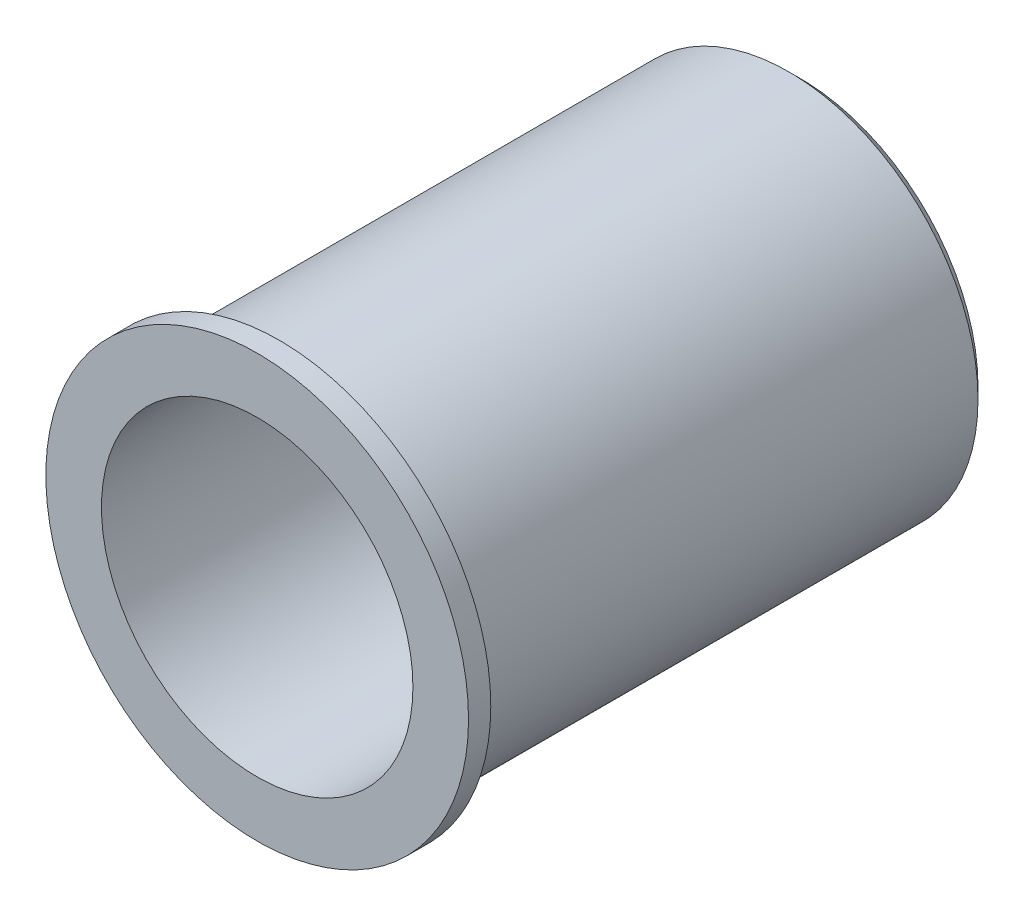
ISO-10303-21;
HEADER;
FILE_DESCRIPTION(('STEP AP214'),'2;1');
FILE_NAME('part.step','',(''),(''),'','','');
FILE_SCHEMA(('AUTOMOTIVE_DESIGN { 1 0 10303 214 1 1 1 1 }'));
ENDSEC;
DATA;
#1=APPLICATION_CONTEXT('core data for automotive mechanical design processes');
#2=APPLICATION_PROTOCOL_DEFINITION('international standard','automotive_design',2000,#1);
#3=PRODUCT_CONTEXT('',#1,'mechanical');
#4=PRODUCT('Part','Part','',(#3));
#5=PRODUCT_RELATED_PRODUCT_CATEGORY('part','',(#4));
#6=PRODUCT_DEFINITION_FORMATION('','',#4);
#7=PRODUCT_DEFINITION_CONTEXT('part definition',#1,'design');
#8=PRODUCT_DEFINITION('design','',#6,#7);
#9=PRODUCT_DEFINITION_SHAPE('','',#8);
#10=(LENGTH_UNIT() NAMED_UNIT(*) SI_UNIT(.MILLI.,.METRE.));
#11=(NAMED_UNIT(*) PLANE_ANGLE_UNIT() SI_UNIT($,.RADIAN.));
#12=(NAMED_UNIT(*) SI_UNIT($,.STERADIAN.) SOLID_ANGLE_UNIT());
#13=UNCERTAINTY_MEASURE_WITH_UNIT(LENGTH_MEASURE(1.E-05),#10,'distance_accuracy_value','');
#14=(GEOMETRIC_REPRESENTATION_CONTEXT(3) GLOBAL_UNCERTAINTY_ASSIGNED_CONTEXT((#13)) GLOBAL_UNIT_ASSIGNED_CONTEXT((#10,
#11,#12)) REPRESENTATION_CONTEXT('',''));
#15=CARTESIAN_POINT('',(0.,0.,0.));
#16=DIRECTION('',(0.,0.,1.));
#17=DIRECTION('',(1.,0.,0.));
#18=AXIS2_PLACEMENT_3D('',#15,#16,#17);
#19=CARTESIAN_POINT('',(0.,0.,24.4));
#20=DIRECTION('',(0.,0.,1.));
#21=DIRECTION('',(1.,0.,0.));
#22=AXIS2_PLACEMENT_3D('',#19,#20,#21);
#23=PLANE('',#22);
#24=CARTESIAN_POINT('',(0.,0.,24.4));
#25=DIRECTION('',(0.,0.,1.));
#26=DIRECTION('',(1.,0.,0.));
#27=AXIS2_PLACEMENT_3D('',#24,#25,#26);
#28=CIRCLE('',#27,7.);
#29=CARTESIAN_POINT('',(7.,0.,24.4));
#30=VERTEX_POINT('',#29);
#31=EDGE_CURVE('E33',#30,#30,#28,.T.);
#32=ORIENTED_EDGE('',*,*,#31,.F.);
#33=EDGE_LOOP('',(#32));
#34=FACE_BOUND('',#33,.T.);
#35=CARTESIAN_POINT('',(0.,0.,24.4));
#36=DIRECTION('',(0.,0.,1.));
#37=DIRECTION('',(1.,0.,0.));
#38=AXIS2_PLACEMENT_3D('',#35,#36,#37);
#39=CIRCLE('',#38,9.5);
#40=CARTESIAN_POINT('',(9.5,0.,24.4));
#41=VERTEX_POINT('',#40);
#42=EDGE_CURVE('E39',#41,#41,#39,.T.);
#43=ORIENTED_EDGE('',*,*,#42,.T.);
#44=EDGE_LOOP('',(#43));
#45=FACE_BOUND('',#44,.T.);
#46=ADVANCED_FACE('F15',(#34,#45),#23,.T.);
#47=CARTESIAN_POINT('',(0.,0.,2.));
#48=DIRECTION('',(0.,0.,1.));
#49=DIRECTION('',(1.,0.,0.));
#50=AXIS2_PLACEMENT_3D('',#47,#48,#49);
#51=CYLINDRICAL_SURFACE('',#50,7.);
#52=CARTESIAN_POINT('',(0.,0.,2.));
#53=DIRECTION('',(0.,0.,1.));
#54=DIRECTION('',(1.,0.,0.));
#55=AXIS2_PLACEMENT_3D('',#52,#53,#54);
#56=CIRCLE('',#55,7.);
#57=CARTESIAN_POINT('',(7.,0.,2.));
#58=VERTEX_POINT('',#57);
#59=EDGE_CURVE('E30',#58,#58,#56,.F.);
#60=ORIENTED_EDGE('',*,*,#59,.T.);
#61=EDGE_LOOP('',(#60));
#62=FACE_BOUND('',#61,.T.);
#63=ORIENTED_EDGE('',*,*,#31,.T.);
#64=EDGE_LOOP('',(#63));
#65=FACE_BOUND('',#64,.T.);
#66=ADVANCED_FACE('F87',(#62,#65),#51,.F.);
#67=CARTESIAN_POINT('',(0.,0.,2.));
#68=DIRECTION('',(0.,0.,1.));
#69=DIRECTION('',(1.,0.,0.));
#70=AXIS2_PLACEMENT_3D('',#67,#68,#69);
#71=PLANE('',#70);
#72=CARTESIAN_POINT('',(-2.5,-4.33012701892219,2.));
#73=DIRECTION('',(0.,0.,1.));
#74=DIRECTION('',(1.,0.,0.));
#75=AXIS2_PLACEMENT_3D('',#72,#73,#74);
#76=CIRCLE('',#75,1.25);
#77=CARTESIAN_POINT('',(-1.25,-4.33012701892219,2.));
#78=VERTEX_POINT('',#77);
#79=EDGE_CURVE('E62',#78,#78,#76,.T.);
#80=ORIENTED_EDGE('',*,*,#79,.F.);
#81=EDGE_LOOP('',(#80));
#82=FACE_BOUND('',#81,.T.);
#83=CARTESIAN_POINT('',(-2.5,4.3301270189222,2.));
#84=DIRECTION('',(0.,0.,1.));
#85=DIRECTION('',(1.,0.,0.));
#86=AXIS2_PLACEMENT_3D('',#83,#84,#85);
#87=CIRCLE('',#86,1.25);
#88=CARTESIAN_POINT('',(-1.25,4.3301270189222,2.));
#89=VERTEX_POINT('',#88);
#90=EDGE_CURVE('E56',#89,#89,#87,.T.);
#91=ORIENTED_EDGE('',*,*,#90,.F.);
#92=EDGE_LOOP('',(#91));
#93=FACE_BOUND('',#92,.T.);
#94=CARTESIAN_POINT('',(5.,0.,2.));
#95=DIRECTION('',(0.,0.,1.));
#96=DIRECTION('',(1.,0.,0.));
#97=AXIS2_PLACEMENT_3D('',#94,#95,#96);
#98=CIRCLE('',#97,1.25);
#99=CARTESIAN_POINT('',(6.25,0.,2.));
#100=VERTEX_POINT('',#99);
#101=EDGE_CURVE('E50',#100,#100,#98,.T.);
#102=ORIENTED_EDGE('',*,*,#101,.F.);
#103=EDGE_LOOP('',(#102));
#104=FACE_BOUND('',#103,.T.);
#105=CARTESIAN_POINT('',(0.,0.,2.));
#106=DIRECTION('',(0.,0.,1.));
#107=DIRECTION('',(1.,0.,0.));
#108=AXIS2_PLACEMENT_3D('',#105,#106,#107);
#109=CIRCLE('',#108,1.5);
#110=CARTESIAN_POINT('',(1.5,0.,2.));
#111=VERTEX_POINT('',#110);
#112=EDGE_CURVE('E42',#111,#111,#109,.T.);
#113=ORIENTED_EDGE('',*,*,#112,.F.);
#114=EDGE_LOOP('',(#113));
#115=FACE_BOUND('',#114,.T.);
#116=ORIENTED_EDGE('',*,*,#59,.F.);
#117=EDGE_LOOP('',(#116));
#118=FACE_BOUND('',#117,.T.);
#119=ADVANCED_FACE('F93',(#82,#93,#104,#115,#118),#71,.T.);
#120=CARTESIAN_POINT('',(0.,0.,23.4));
#121=DIRECTION('',(0.,0.,1.));
#122=DIRECTION('',(1.,0.,0.));
#123=AXIS2_PLACEMENT_3D('',#120,#121,#122);
#124=CYLINDRICAL_SURFACE('',#123,9.5);
#125=CARTESIAN_POINT('',(0.,0.,23.4));
#126=DIRECTION('',(0.,0.,1.));
#127=DIRECTION('',(1.,0.,0.));
#128=AXIS2_PLACEMENT_3D('',#125,#126,#127);
#129=CIRCLE('',#128,9.5);
#130=CARTESIAN_POINT('',(9.5,0.,23.4));
#131=VERTEX_POINT('',#130);
#132=EDGE_CURVE('E36',#131,#131,#129,.T.);
#133=ORIENTED_EDGE('',*,*,#132,.T.);
#134=EDGE_LOOP('',(#133));
#135=FACE_BOUND('',#134,.T.);
#136=ORIENTED_EDGE('',*,*,#42,.F.);
#137=EDGE_LOOP('',(#136));
#138=FACE_BOUND('',#137,.T.);
#139=ADVANCED_FACE('F114',(#135,#138),#124,.T.);
#140=CARTESIAN_POINT('',(0.,0.,23.4));
#141=DIRECTION('',(0.,0.,1.));
#142=DIRECTION('',(1.,0.,0.));
#143=AXIS2_PLACEMENT_3D('',#140,#141,#142);
#144=PLANE('',#143);
#145=ORIENTED_EDGE('',*,*,#132,.F.);
#146=EDGE_LOOP('',(#145));
#147=FACE_BOUND('',#146,.T.);
#148=CARTESIAN_POINT('',(0.,0.,23.4));
#149=DIRECTION('',(0.,0.,1.));
#150=DIRECTION('',(1.,0.,0.));
#151=AXIS2_PLACEMENT_3D('',#148,#149,#150);
#152=CIRCLE('',#151,8.5);
#153=CARTESIAN_POINT('',(8.5,0.,23.4));
#154=VERTEX_POINT('',#153);
#155=EDGE_CURVE('E26',#154,#154,#152,.T.);
#156=ORIENTED_EDGE('',*,*,#155,.T.);
#157=EDGE_LOOP('',(#156));
#158=FACE_BOUND('',#157,.T.);
#159=ADVANCED_FACE('F102',(#147,#158),#144,.F.);
#160=CARTESIAN_POINT('',(0.,0.,0.));
#161=DIRECTION('',(0.,0.,1.));
#162=DIRECTION('',(1.,0.,0.));
#163=AXIS2_PLACEMENT_3D('',#160,#161,#162);
#164=PLANE('',#163);
#165=CARTESIAN_POINT('',(0.,0.,0.));
#166=DIRECTION('',(0.,0.,1.));
#167=DIRECTION('',(1.,0.,0.));
#168=AXIS2_PLACEMENT_3D('',#165,#166,#167);
#169=CIRCLE('',#168,8.);
#170=CARTESIAN_POINT('',(8.,0.,0.));
#171=VERTEX_POINT('',#170);
#172=EDGE_CURVE('E10',#171,#171,#169,.F.);
#173=ORIENTED_EDGE('',*,*,#172,.T.);
#174=EDGE_LOOP('',(#173));
#175=FACE_BOUND('',#174,.T.);
#176=CARTESIAN_POINT('',(-2.5,-4.33012701892219,0.));
#177=DIRECTION('',(0.,0.,1.));
#178=DIRECTION('',(1.,0.,0.));
#179=AXIS2_PLACEMENT_3D('',#176,#177,#178);
#180=CIRCLE('',#179,1.25);
#181=CARTESIAN_POINT('',(-1.25,-4.33012701892219,0.));
#182=VERTEX_POINT('',#181);
#183=EDGE_CURVE('E65',#182,#182,#180,.T.);
#184=ORIENTED_EDGE('',*,*,#183,.T.);
#185=EDGE_LOOP('',(#184));
#186=FACE_BOUND('',#185,.T.);
#187=CARTESIAN_POINT('',(-2.5,4.3301270189222,0.));
#188=DIRECTION('',(0.,0.,1.));
#189=DIRECTION('',(1.,0.,0.));
#190=AXIS2_PLACEMENT_3D('',#187,#188,#189);
#191=CIRCLE('',#190,1.25);
#192=CARTESIAN_POINT('',(-1.25,4.3301270189222,0.));
#193=VERTEX_POINT('',#192);
#194=EDGE_CURVE('E59',#193,#193,#191,.T.);
#195=ORIENTED_EDGE('',*,*,#194,.T.);
#196=EDGE_LOOP('',(#195));
#197=FACE_BOUND('',#196,.T.);
#198=CARTESIAN_POINT('',(5.,0.,0.));
#199=DIRECTION('',(0.,0.,1.));
#200=DIRECTION('',(1.,0.,0.));
#201=AXIS2_PLACEMENT_3D('',#198,#199,#200);
#202=CIRCLE('',#201,1.25);
#203=CARTESIAN_POINT('',(6.25,0.,0.));
#204=VERTEX_POINT('',#203);
#205=EDGE_CURVE('E53',#204,#204,#202,.T.);
#206=ORIENTED_EDGE('',*,*,#205,.T.);
#207=EDGE_LOOP('',(#206));
#208=FACE_BOUND('',#207,.T.);
#209=CARTESIAN_POINT('',(0.,0.,0.));
#210=DIRECTION('',(0.,0.,1.));
#211=DIRECTION('',(1.,0.,0.));
#212=AXIS2_PLACEMENT_3D('',#209,#210,#211);
#213=CIRCLE('',#212,1.5);
#214=CARTESIAN_POINT('',(1.5,0.,0.));
#215=VERTEX_POINT('',#214);
#216=EDGE_CURVE('E47',#215,#215,#213,.T.);
#217=ORIENTED_EDGE('',*,*,#216,.T.);
#218=EDGE_LOOP('',(#217));
#219=FACE_BOUND('',#218,.T.);
#220=ADVANCED_FACE('F69',(#175,#186,#197,#208,#219),#164,.F.);
#221=CARTESIAN_POINT('',(0.,0.,24.4));
#222=DIRECTION('',(0.,0.,-1.));
#223=DIRECTION('',(-1.,0.,0.));
#224=AXIS2_PLACEMENT_3D('',#221,#222,#223);
#225=CYLINDRICAL_SURFACE('',#224,8.5);
#226=CARTESIAN_POINT('',(0.,0.,0.5));
#227=DIRECTION('',(0.,0.,1.));
#228=DIRECTION('',(1.,0.,0.));
#229=AXIS2_PLACEMENT_3D('',#226,#227,#228);
#230=CIRCLE('',#229,8.5);
#231=CARTESIAN_POINT('',(8.5,0.,0.5));
#232=VERTEX_POINT('',#231);
#233=EDGE_CURVE('E22',#232,#232,#230,.T.);
#234=ORIENTED_EDGE('',*,*,#233,.T.);
#235=EDGE_LOOP('',(#234));
#236=FACE_BOUND('',#235,.T.);
#237=ORIENTED_EDGE('',*,*,#155,.F.);
#238=EDGE_LOOP('',(#237));
#239=FACE_BOUND('',#238,.T.);
#240=ADVANCED_FACE('F101',(#236,#239),#225,.T.);
#241=CARTESIAN_POINT('',(0.,0.,0.));
#242=DIRECTION('',(0.,0.,1.));
#243=DIRECTION('',(1.,0.,0.));
#244=AXIS2_PLACEMENT_3D('',#241,#242,#243);
#245=CYLINDRICAL_SURFACE('',#244,1.5);
#246=ORIENTED_EDGE('',*,*,#112,.T.);
#247=EDGE_LOOP('',(#246));
#248=FACE_BOUND('',#247,.T.);
#249=ORIENTED_EDGE('',*,*,#216,.F.);
#250=EDGE_LOOP('',(#249));
#251=FACE_BOUND('',#250,.T.);
#252=ADVANCED_FACE('F104',(#248,#251),#245,.F.);
#253=CARTESIAN_POINT('',(5.,0.,0.));
#254=DIRECTION('',(0.,0.,1.));
#255=DIRECTION('',(1.,0.,0.));
#256=AXIS2_PLACEMENT_3D('',#253,#254,#255);
#257=CYLINDRICAL_SURFACE('',#256,1.25);
#258=ORIENTED_EDGE('',*,*,#101,.T.);
#259=EDGE_LOOP('',(#258));
#260=FACE_BOUND('',#259,.T.);
#261=ORIENTED_EDGE('',*,*,#205,.F.);
#262=EDGE_LOOP('',(#261));
#263=FACE_BOUND('',#262,.T.);
#264=ADVANCED_FACE('F83',(#260,#263),#257,.F.);
#265=CARTESIAN_POINT('',(-2.5,4.3301270189222,0.));
#266=DIRECTION('',(0.,0.,1.));
#267=DIRECTION('',(1.,0.,0.));
#268=AXIS2_PLACEMENT_3D('',#265,#266,#267);
#269=CYLINDRICAL_SURFACE('',#268,1.25);
#270=ORIENTED_EDGE('',*,*,#90,.T.);
#271=EDGE_LOOP('',(#270));
#272=FACE_BOUND('',#271,.T.);
#273=ORIENTED_EDGE('',*,*,#194,.F.);
#274=EDGE_LOOP('',(#273));
#275=FACE_BOUND('',#274,.T.);
#276=ADVANCED_FACE('F74',(#272,#275),#269,.F.);
#277=CARTESIAN_POINT('',(-2.5,-4.33012701892219,0.));
#278=DIRECTION('',(0.,0.,1.));
#279=DIRECTION('',(1.,0.,0.));
#280=AXIS2_PLACEMENT_3D('',#277,#278,#279);
#281=CYLINDRICAL_SURFACE('',#280,1.25);
#282=ORIENTED_EDGE('',*,*,#79,.T.);
#283=EDGE_LOOP('',(#282));
#284=FACE_BOUND('',#283,.T.);
#285=ORIENTED_EDGE('',*,*,#183,.F.);
#286=EDGE_LOOP('',(#285));
#287=FACE_BOUND('',#286,.T.);
#288=ADVANCED_FACE('F72',(#284,#287),#281,.F.);
#289=CARTESIAN_POINT('',(0.,0.,0.5));
#290=DIRECTION('',(0.,0.,1.));
#291=DIRECTION('',(1.,0.,0.));
#292=AXIS2_PLACEMENT_3D('',#289,#290,#291);
#293=CONICAL_SURFACE('',#292,8.5,0.785398163397448);
#294=ORIENTED_EDGE('',*,*,#172,.F.);
#295=EDGE_LOOP('',(#294));
#296=FACE_BOUND('',#295,.T.);
#297=ORIENTED_EDGE('',*,*,#233,.F.);
#298=EDGE_LOOP('',(#297));
#299=FACE_BOUND('',#298,.T.);
#300=ADVANCED_FACE('F17',(#296,#299),#293,.T.);
#301=CLOSED_SHELL('',(#46,#66,#119,#139,#159,#220,#240,#252,#264,#276,#288,#300));
#302=MANIFOLD_SOLID_BREP('B1',#301);
#303=ADVANCED_BREP_SHAPE_REPRESENTATION('',(#18,#302),#14);
#304=SHAPE_DEFINITION_REPRESENTATION(#9,#303);
ENDSEC;
END-ISO-10303-21;
